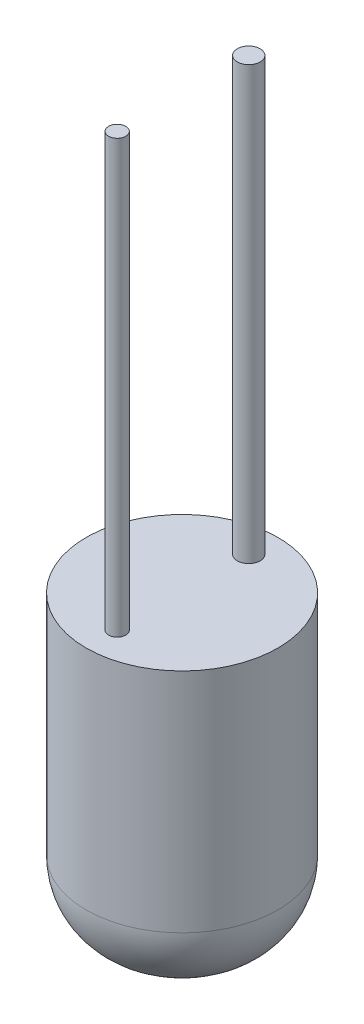
ISO-10303-21;
HEADER;
FILE_DESCRIPTION(('STEP AP214'),'2;1');
FILE_NAME('part.step','',(''),(''),'','','');
FILE_SCHEMA(('AUTOMOTIVE_DESIGN { 1 0 10303 214 1 1 1 1 }'));
ENDSEC;
DATA;
#1=APPLICATION_CONTEXT('core data for automotive mechanical design processes');
#2=APPLICATION_PROTOCOL_DEFINITION('international standard','automotive_design',2000,#1);
#3=PRODUCT_CONTEXT('',#1,'mechanical');
#4=PRODUCT('Part','Part','',(#3));
#5=PRODUCT_RELATED_PRODUCT_CATEGORY('part','',(#4));
#6=PRODUCT_DEFINITION_FORMATION('','',#4);
#7=PRODUCT_DEFINITION_CONTEXT('part definition',#1,'design');
#8=PRODUCT_DEFINITION('design','',#6,#7);
#9=PRODUCT_DEFINITION_SHAPE('','',#8);
#10=(LENGTH_UNIT() NAMED_UNIT(*) SI_UNIT(.MILLI.,.METRE.));
#11=(NAMED_UNIT(*) PLANE_ANGLE_UNIT() SI_UNIT($,.RADIAN.));
#12=(NAMED_UNIT(*) SI_UNIT($,.STERADIAN.) SOLID_ANGLE_UNIT());
#13=UNCERTAINTY_MEASURE_WITH_UNIT(LENGTH_MEASURE(1.E-05),#10,'distance_accuracy_value','');
#14=(GEOMETRIC_REPRESENTATION_CONTEXT(3) GLOBAL_UNCERTAINTY_ASSIGNED_CONTEXT((#13)) GLOBAL_UNIT_ASSIGNED_CONTEXT((#10,
#11,#12)) REPRESENTATION_CONTEXT('',''));
#15=CARTESIAN_POINT('',(0.,0.,0.));
#16=DIRECTION('',(0.,0.,1.));
#17=DIRECTION('',(1.,0.,0.));
#18=AXIS2_PLACEMENT_3D('',#15,#16,#17);
#19=CARTESIAN_POINT('',(0.,7.112,0.));
#20=DIRECTION('',(0.,-1.,0.));
#21=DIRECTION('',(0.,0.,-1.));
#22=AXIS2_PLACEMENT_3D('',#19,#20,#21);
#23=CYLINDRICAL_SURFACE('',#22,2.25432031593658);
#24=CARTESIAN_POINT('',(0.,1.77799999999999,0.));
#25=DIRECTION('',(0.,1.,0.));
#26=DIRECTION('',(0.,0.,1.));
#27=AXIS2_PLACEMENT_3D('',#24,#25,#26);
#28=CIRCLE('',#27,2.25432031593658);
#29=CARTESIAN_POINT('',(0.,1.77799999999999,2.25432031593658));
#30=VERTEX_POINT('',#29);
#31=EDGE_CURVE('E39',#30,#30,#28,.T.);
#32=ORIENTED_EDGE('',*,*,#31,.T.);
#33=EDGE_LOOP('',(#32));
#34=FACE_BOUND('',#33,.T.);
#35=CARTESIAN_POINT('',(0.,7.112,0.));
#36=DIRECTION('',(0.,1.,0.));
#37=DIRECTION('',(0.,0.,1.));
#38=AXIS2_PLACEMENT_3D('',#35,#36,#37);
#39=CIRCLE('',#38,2.25432031593658);
#40=CARTESIAN_POINT('',(0.,7.112,2.25432031593658));
#41=VERTEX_POINT('',#40);
#42=EDGE_CURVE('E43',#41,#41,#39,.T.);
#43=ORIENTED_EDGE('',*,*,#42,.F.);
#44=EDGE_LOOP('',(#43));
#45=FACE_BOUND('',#44,.T.);
#46=ADVANCED_FACE('F32',(#34,#45),#23,.T.);
#47=CARTESIAN_POINT('',(0.,7.112,0.));
#48=DIRECTION('',(0.,1.,0.));
#49=DIRECTION('',(0.,0.,1.));
#50=AXIS2_PLACEMENT_3D('',#47,#48,#49);
#51=PLANE('',#50);
#52=CARTESIAN_POINT('',(0.,7.112,1.52494477004349));
#53=DIRECTION('',(0.,1.,0.));
#54=DIRECTION('',(0.,0.,1.));
#55=AXIS2_PLACEMENT_3D('',#52,#53,#54);
#56=CIRCLE('',#55,0.202182998317177);
#57=CARTESIAN_POINT('',(0.,7.112,1.72712776836067));
#58=VERTEX_POINT('',#57);
#59=EDGE_CURVE('E56',#58,#58,#56,.T.);
#60=ORIENTED_EDGE('',*,*,#59,.F.);
#61=EDGE_LOOP('',(#60));
#62=FACE_BOUND('',#61,.T.);
#63=CARTESIAN_POINT('',(0.,7.112,-1.56794712927044));
#64=DIRECTION('',(0.,1.,0.));
#65=DIRECTION('',(0.,0.,1.));
#66=AXIS2_PLACEMENT_3D('',#63,#64,#65);
#67=CIRCLE('',#66,0.268830557700392);
#68=CARTESIAN_POINT('',(0.,7.112,-1.29911657157004));
#69=VERTEX_POINT('',#68);
#70=EDGE_CURVE('E50',#69,#69,#67,.T.);
#71=ORIENTED_EDGE('',*,*,#70,.F.);
#72=EDGE_LOOP('',(#71));
#73=FACE_BOUND('',#72,.T.);
#74=ORIENTED_EDGE('',*,*,#42,.T.);
#75=EDGE_LOOP('',(#74));
#76=FACE_BOUND('',#75,.T.);
#77=ADVANCED_FACE('F71',(#62,#73,#76),#51,.T.);
#78=CARTESIAN_POINT('',(0.,0.,0.));
#79=DIRECTION('',(0.,1.,0.));
#80=DIRECTION('',(0.,0.,1.));
#81=AXIS2_PLACEMENT_3D('',#78,#79,#80);
#82=PLANE('',#81);
#83=CARTESIAN_POINT('',(0.,0.,0.));
#84=DIRECTION('',(0.,1.,0.));
#85=DIRECTION('',(0.,0.,1.));
#86=AXIS2_PLACEMENT_3D('',#83,#84,#85);
#87=CIRCLE('',#86,0.476320315936584);
#88=CARTESIAN_POINT('',(0.,0.,0.476320315936584));
#89=VERTEX_POINT('',#88);
#90=EDGE_CURVE('E10',#89,#89,#87,.F.);
#91=ORIENTED_EDGE('',*,*,#90,.T.);
#92=EDGE_LOOP('',(#91));
#93=FACE_BOUND('',#92,.T.);
#94=ADVANCED_FACE('F74',(#93),#82,.F.);
#95=CARTESIAN_POINT('',(0.,17.272,-1.56794712927044));
#96=DIRECTION('',(0.,-1.,0.));
#97=DIRECTION('',(0.,0.,-1.));
#98=AXIS2_PLACEMENT_3D('',#95,#96,#97);
#99=CYLINDRICAL_SURFACE('',#98,0.268830557700392);
#100=CARTESIAN_POINT('',(0.,17.272,-1.56794712927044));
#101=DIRECTION('',(0.,1.,0.));
#102=DIRECTION('',(0.,0.,1.));
#103=AXIS2_PLACEMENT_3D('',#100,#101,#102);
#104=CIRCLE('',#103,0.268830557700392);
#105=CARTESIAN_POINT('',(0.,17.272,-1.29911657157004));
#106=VERTEX_POINT('',#105);
#107=EDGE_CURVE('E47',#106,#106,#104,.T.);
#108=ORIENTED_EDGE('',*,*,#107,.F.);
#109=EDGE_LOOP('',(#108));
#110=FACE_BOUND('',#109,.T.);
#111=ORIENTED_EDGE('',*,*,#70,.T.);
#112=EDGE_LOOP('',(#111));
#113=FACE_BOUND('',#112,.T.);
#114=ADVANCED_FACE('F85',(#110,#113),#99,.T.);
#115=CARTESIAN_POINT('',(0.,17.272,-1.56794712927044));
#116=DIRECTION('',(0.,1.,0.));
#117=DIRECTION('',(0.,0.,1.));
#118=AXIS2_PLACEMENT_3D('',#115,#116,#117);
#119=PLANE('',#118);
#120=ORIENTED_EDGE('',*,*,#107,.T.);
#121=EDGE_LOOP('',(#120));
#122=FACE_BOUND('',#121,.T.);
#123=ADVANCED_FACE('F67',(#122),#119,.T.);
#124=CARTESIAN_POINT('',(0.,17.272,1.52494477004349));
#125=DIRECTION('',(0.,-1.,0.));
#126=DIRECTION('',(0.,0.,-1.));
#127=AXIS2_PLACEMENT_3D('',#124,#125,#126);
#128=CYLINDRICAL_SURFACE('',#127,0.202182998317177);
#129=CARTESIAN_POINT('',(0.,17.272,1.52494477004349));
#130=DIRECTION('',(0.,1.,0.));
#131=DIRECTION('',(0.,0.,1.));
#132=AXIS2_PLACEMENT_3D('',#129,#130,#131);
#133=CIRCLE('',#132,0.202182998317177);
#134=CARTESIAN_POINT('',(0.,17.272,1.72712776836067));
#135=VERTEX_POINT('',#134);
#136=EDGE_CURVE('E53',#135,#135,#133,.T.);
#137=ORIENTED_EDGE('',*,*,#136,.F.);
#138=EDGE_LOOP('',(#137));
#139=FACE_BOUND('',#138,.T.);
#140=ORIENTED_EDGE('',*,*,#59,.T.);
#141=EDGE_LOOP('',(#140));
#142=FACE_BOUND('',#141,.T.);
#143=ADVANCED_FACE('F64',(#139,#142),#128,.T.);
#144=CARTESIAN_POINT('',(0.,17.272,1.52494477004349));
#145=DIRECTION('',(0.,1.,0.));
#146=DIRECTION('',(0.,0.,1.));
#147=AXIS2_PLACEMENT_3D('',#144,#145,#146);
#148=PLANE('',#147);
#149=ORIENTED_EDGE('',*,*,#136,.T.);
#150=EDGE_LOOP('',(#149));
#151=FACE_BOUND('',#150,.T.);
#152=ADVANCED_FACE('F62',(#151),#148,.T.);
#153=CARTESIAN_POINT('',(0.,1.778,0.));
#154=DIRECTION('',(0.,1.,0.));
#155=DIRECTION('',(0.,0.,1.));
#156=AXIS2_PLACEMENT_3D('',#153,#154,#155);
#157=DEGENERATE_TOROIDAL_SURFACE('',#156,0.476320315936584,1.778,.T.);
#158=ORIENTED_EDGE('',*,*,#90,.F.);
#159=EDGE_LOOP('',(#158));
#160=FACE_BOUND('',#159,.T.);
#161=ORIENTED_EDGE('',*,*,#31,.F.);
#162=EDGE_LOOP('',(#161));
#163=FACE_BOUND('',#162,.T.);
#164=ADVANCED_FACE('F34',(#160,#163),#157,.T.);
#165=CLOSED_SHELL('',(#46,#77,#94,#114,#123,#143,#152,#164));
#166=MANIFOLD_SOLID_BREP('B2',#165);
#167=ADVANCED_BREP_SHAPE_REPRESENTATION('',(#18,#166),#14);
#168=SHAPE_DEFINITION_REPRESENTATION(#9,#167);
ENDSEC;
END-ISO-10303-21;
